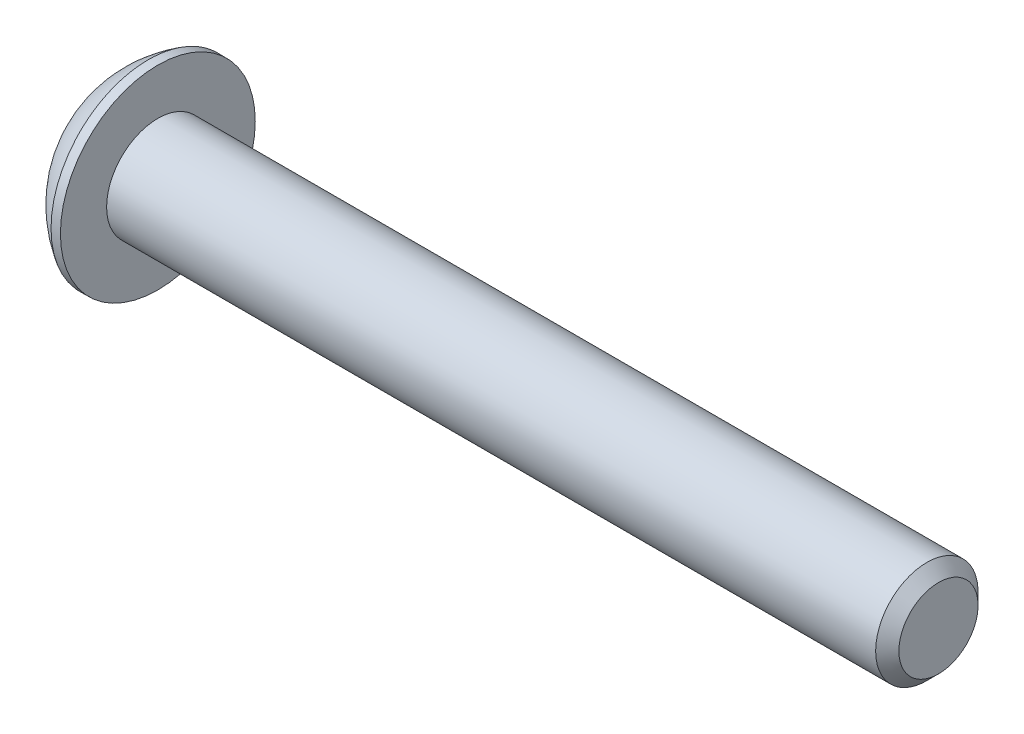
ISO-10303-21;
HEADER;
FILE_DESCRIPTION(('STEP AP214'),'2;1');
FILE_NAME('part.step','',(''),(''),'','','');
FILE_SCHEMA(('AUTOMOTIVE_DESIGN { 1 0 10303 214 1 1 1 1 }'));
ENDSEC;
DATA;
#1=APPLICATION_CONTEXT('core data for automotive mechanical design processes');
#2=APPLICATION_PROTOCOL_DEFINITION('international standard','automotive_design',2000,#1);
#3=PRODUCT_CONTEXT('',#1,'mechanical');
#4=PRODUCT('Part','Part','',(#3));
#5=PRODUCT_RELATED_PRODUCT_CATEGORY('part','',(#4));
#6=PRODUCT_DEFINITION_FORMATION('','',#4);
#7=PRODUCT_DEFINITION_CONTEXT('part definition',#1,'design');
#8=PRODUCT_DEFINITION('design','',#6,#7);
#9=PRODUCT_DEFINITION_SHAPE('','',#8);
#10=(LENGTH_UNIT() NAMED_UNIT(*) SI_UNIT(.MILLI.,.METRE.));
#11=(NAMED_UNIT(*) PLANE_ANGLE_UNIT() SI_UNIT($,.RADIAN.));
#12=(NAMED_UNIT(*) SI_UNIT($,.STERADIAN.) SOLID_ANGLE_UNIT());
#13=UNCERTAINTY_MEASURE_WITH_UNIT(LENGTH_MEASURE(1.E-05),#10,'distance_accuracy_value','');
#14=(GEOMETRIC_REPRESENTATION_CONTEXT(3) GLOBAL_UNCERTAINTY_ASSIGNED_CONTEXT((#13)) GLOBAL_UNIT_ASSIGNED_CONTEXT((#10,
#11,#12)) REPRESENTATION_CONTEXT('',''));
#15=CARTESIAN_POINT('',(0.,0.,0.));
#16=DIRECTION('',(0.,0.,1.));
#17=DIRECTION('',(1.,0.,0.));
#18=AXIS2_PLACEMENT_3D('',#15,#16,#17);
#19=CARTESIAN_POINT('',(1.32080000000034,0.,0.));
#20=DIRECTION('',(-1.,0.,0.));
#21=DIRECTION('',(0.,0.,1.));
#22=AXIS2_PLACEMENT_3D('',#19,#20,#21);
#23=CONICAL_SURFACE('',#22,1.1937999999998,1.04719755119608);
#24=CARTESIAN_POINT('',(2.01004075135902,0.,4.44089209850063E-13));
#25=VERTEX_POINT('',#24);
#26=VERTEX_LOOP('',#25);
#27=FACE_BOUND('',#26,.T.);
#28=CARTESIAN_POINT('',(1.32080000000009,0.,0.));
#29=DIRECTION('',(-1.,0.,0.));
#30=DIRECTION('',(0.,0.,1.));
#31=AXIS2_PLACEMENT_3D('',#28,#29,#30);
#32=CIRCLE('',#31,1.19380000000024);
#33=CARTESIAN_POINT('',(1.32080000000004,-1.03386112703797,0.59690000000006));
#34=VERTEX_POINT('',#33);
#35=CARTESIAN_POINT('',(1.32080000000004,0.,1.19380000000012));
#36=VERTEX_POINT('',#35);
#37=EDGE_CURVE('E18',#34,#36,#32,.T.);
#38=ORIENTED_EDGE('',*,*,#37,.T.);
#39=CARTESIAN_POINT('',(1.32080000000009,0.,0.));
#40=DIRECTION('',(-1.,0.,0.));
#41=DIRECTION('',(0.,0.,1.));
#42=AXIS2_PLACEMENT_3D('',#39,#40,#41);
#43=CIRCLE('',#42,1.19380000000024);
#44=CARTESIAN_POINT('',(1.32080000000004,1.03386112703797,0.596900000000061));
#45=VERTEX_POINT('',#44);
#46=EDGE_CURVE('E146',#36,#45,#43,.T.);
#47=ORIENTED_EDGE('',*,*,#46,.T.);
#48=CARTESIAN_POINT('',(1.32080000000009,0.,0.));
#49=DIRECTION('',(-1.,0.,0.));
#50=DIRECTION('',(0.,0.,1.));
#51=AXIS2_PLACEMENT_3D('',#48,#49,#50);
#52=CIRCLE('',#51,1.19380000000024);
#53=CARTESIAN_POINT('',(1.32080000000004,1.03386112703797,-0.596900000000061));
#54=VERTEX_POINT('',#53);
#55=EDGE_CURVE('E316',#45,#54,#52,.T.);
#56=ORIENTED_EDGE('',*,*,#55,.T.);
#57=CARTESIAN_POINT('',(1.32080000000009,0.,0.));
#58=DIRECTION('',(-1.,0.,0.));
#59=DIRECTION('',(0.,0.,1.));
#60=AXIS2_PLACEMENT_3D('',#57,#58,#59);
#61=CIRCLE('',#60,1.19380000000024);
#62=CARTESIAN_POINT('',(1.32080000000004,1.49457637585666E-12,-1.19380000000012));
#63=VERTEX_POINT('',#62);
#64=EDGE_CURVE('E317',#54,#63,#61,.T.);
#65=ORIENTED_EDGE('',*,*,#64,.T.);
#66=CARTESIAN_POINT('',(1.32080000000009,0.,0.));
#67=DIRECTION('',(-1.,0.,0.));
#68=DIRECTION('',(0.,0.,1.));
#69=AXIS2_PLACEMENT_3D('',#66,#67,#68);
#70=CIRCLE('',#69,1.19380000000024);
#71=CARTESIAN_POINT('',(1.32080000000004,-1.03386112703797,-0.59690000000006));
#72=VERTEX_POINT('',#71);
#73=EDGE_CURVE('E91',#63,#72,#70,.T.);
#74=ORIENTED_EDGE('',*,*,#73,.T.);
#75=CARTESIAN_POINT('',(1.32080000000009,0.,0.));
#76=DIRECTION('',(-1.,0.,0.));
#77=DIRECTION('',(0.,0.,1.));
#78=AXIS2_PLACEMENT_3D('',#75,#76,#77);
#79=CIRCLE('',#78,1.19380000000024);
#80=EDGE_CURVE('E87',#72,#34,#79,.T.);
#81=ORIENTED_EDGE('',*,*,#80,.T.);
#82=EDGE_LOOP('',(#38,#47,#56,#65,#74,#81));
#83=FACE_BOUND('',#82,.T.);
#84=ADVANCED_FACE('F15',(#27,#83),#23,.F.);
#85=CARTESIAN_POINT('',(1.3208,-2.06772225407572,-1.1938));
#86=DIRECTION('',(1.,0.,0.));
#87=DIRECTION('',(0.,0.,-1.));
#88=AXIS2_PLACEMENT_3D('',#85,#86,#87);
#89=PLANE('',#88);
#90=DIRECTION('',(0.,0.5,0.866025403784439));
#91=VECTOR('',#90,1.);
#92=CARTESIAN_POINT('',(1.3208,-1.37848150271715,0.));
#93=LINE('',#92,#91);
#94=CARTESIAN_POINT('',(1.3208,-0.689240751358574,1.1938));
#95=VERTEX_POINT('',#94);
#96=EDGE_CURVE('E99',#95,#34,#93,.F.);
#97=ORIENTED_EDGE('',*,*,#96,.F.);
#98=DIRECTION('',(0.,1.,0.));
#99=VECTOR('',#98,1.);
#100=CARTESIAN_POINT('',(1.3208,-0.689240751358574,1.1938));
#101=LINE('',#100,#99);
#102=EDGE_CURVE('E101',#36,#95,#101,.F.);
#103=ORIENTED_EDGE('',*,*,#102,.F.);
#104=ORIENTED_EDGE('',*,*,#37,.F.);
#105=EDGE_LOOP('',(#97,#103,#104));
#106=FACE_BOUND('',#105,.T.);
#107=ADVANCED_FACE('F97',(#106),#89,.F.);
#108=CARTESIAN_POINT('',(1.3208,-2.06772225407572,-1.1938));
#109=DIRECTION('',(1.,0.,0.));
#110=DIRECTION('',(0.,0.,-1.));
#111=AXIS2_PLACEMENT_3D('',#108,#109,#110);
#112=PLANE('',#111);
#113=DIRECTION('',(0.,-0.5,0.866025403784439));
#114=VECTOR('',#113,1.);
#115=CARTESIAN_POINT('',(1.3208,-0.689240751358574,-1.1938));
#116=LINE('',#115,#114);
#117=CARTESIAN_POINT('',(1.3208,-1.37848150271715,0.));
#118=VERTEX_POINT('',#117);
#119=EDGE_CURVE('E107',#118,#72,#116,.F.);
#120=ORIENTED_EDGE('',*,*,#119,.F.);
#121=DIRECTION('',(0.,0.5,0.866025403784439));
#122=VECTOR('',#121,1.);
#123=CARTESIAN_POINT('',(1.3208,-1.37848150271715,0.));
#124=LINE('',#123,#122);
#125=EDGE_CURVE('E104',#34,#118,#124,.F.);
#126=ORIENTED_EDGE('',*,*,#125,.F.);
#127=ORIENTED_EDGE('',*,*,#80,.F.);
#128=EDGE_LOOP('',(#120,#126,#127));
#129=FACE_BOUND('',#128,.T.);
#130=ADVANCED_FACE('F105',(#129),#112,.F.);
#131=CARTESIAN_POINT('',(1.3208,-2.06772225407572,-1.1938));
#132=DIRECTION('',(1.,0.,0.));
#133=DIRECTION('',(0.,0.,-1.));
#134=AXIS2_PLACEMENT_3D('',#131,#132,#133);
#135=PLANE('',#134);
#136=DIRECTION('',(0.,1.,0.));
#137=VECTOR('',#136,1.);
#138=CARTESIAN_POINT('',(1.3208,0.689240751358577,-1.1938));
#139=LINE('',#138,#137);
#140=CARTESIAN_POINT('',(1.3208,-0.689240751358574,-1.1938));
#141=VERTEX_POINT('',#140);
#142=EDGE_CURVE('E286',#141,#63,#139,.T.);
#143=ORIENTED_EDGE('',*,*,#142,.F.);
#144=DIRECTION('',(0.,-0.5,0.866025403784439));
#145=VECTOR('',#144,1.);
#146=CARTESIAN_POINT('',(1.3208,-0.689240751358574,-1.1938));
#147=LINE('',#146,#145);
#148=EDGE_CURVE('E298',#72,#141,#147,.F.);
#149=ORIENTED_EDGE('',*,*,#148,.F.);
#150=ORIENTED_EDGE('',*,*,#73,.F.);
#151=EDGE_LOOP('',(#143,#149,#150));
#152=FACE_BOUND('',#151,.T.);
#153=ADVANCED_FACE('F189',(#152),#135,.F.);
#154=CARTESIAN_POINT('',(1.3208,-2.06772225407572,-1.1938));
#155=DIRECTION('',(1.,0.,0.));
#156=DIRECTION('',(0.,0.,-1.));
#157=AXIS2_PLACEMENT_3D('',#154,#155,#156);
#158=PLANE('',#157);
#159=DIRECTION('',(0.,-0.5,-0.866025403784439));
#160=VECTOR('',#159,1.);
#161=CARTESIAN_POINT('',(1.3208,1.37848150271715,0.));
#162=LINE('',#161,#160);
#163=CARTESIAN_POINT('',(1.3208,0.689240751358577,-1.1938));
#164=VERTEX_POINT('',#163);
#165=EDGE_CURVE('E272',#164,#54,#162,.F.);
#166=ORIENTED_EDGE('',*,*,#165,.F.);
#167=DIRECTION('',(0.,1.,0.));
#168=VECTOR('',#167,1.);
#169=CARTESIAN_POINT('',(1.3208,0.689240751358577,-1.1938));
#170=LINE('',#169,#168);
#171=EDGE_CURVE('E283',#63,#164,#170,.T.);
#172=ORIENTED_EDGE('',*,*,#171,.F.);
#173=ORIENTED_EDGE('',*,*,#64,.F.);
#174=EDGE_LOOP('',(#166,#172,#173));
#175=FACE_BOUND('',#174,.T.);
#176=ADVANCED_FACE('F185',(#175),#158,.F.);
#177=CARTESIAN_POINT('',(1.3208,-2.06772225407572,-1.1938));
#178=DIRECTION('',(1.,0.,0.));
#179=DIRECTION('',(0.,0.,-1.));
#180=AXIS2_PLACEMENT_3D('',#177,#178,#179);
#181=PLANE('',#180);
#182=DIRECTION('',(0.,0.5,-0.866025403784439));
#183=VECTOR('',#182,1.);
#184=CARTESIAN_POINT('',(1.3208,0.689240751358576,1.1938));
#185=LINE('',#184,#183);
#186=CARTESIAN_POINT('',(1.3208,1.37848150271715,0.));
#187=VERTEX_POINT('',#186);
#188=EDGE_CURVE('E251',#187,#45,#185,.F.);
#189=ORIENTED_EDGE('',*,*,#188,.F.);
#190=DIRECTION('',(0.,-0.5,-0.866025403784439));
#191=VECTOR('',#190,1.);
#192=CARTESIAN_POINT('',(1.3208,1.37848150271715,0.));
#193=LINE('',#192,#191);
#194=EDGE_CURVE('E270',#54,#187,#193,.F.);
#195=ORIENTED_EDGE('',*,*,#194,.F.);
#196=ORIENTED_EDGE('',*,*,#55,.F.);
#197=EDGE_LOOP('',(#189,#195,#196));
#198=FACE_BOUND('',#197,.T.);
#199=ADVANCED_FACE('F181',(#198),#181,.F.);
#200=CARTESIAN_POINT('',(1.3208,-2.06772225407572,-1.1938));
#201=DIRECTION('',(1.,0.,0.));
#202=DIRECTION('',(0.,0.,-1.));
#203=AXIS2_PLACEMENT_3D('',#200,#201,#202);
#204=PLANE('',#203);
#205=DIRECTION('',(0.,1.,0.));
#206=VECTOR('',#205,1.);
#207=CARTESIAN_POINT('',(1.3208,-0.689240751358574,1.1938));
#208=LINE('',#207,#206);
#209=CARTESIAN_POINT('',(1.3208,0.689240751358576,1.1938));
#210=VERTEX_POINT('',#209);
#211=EDGE_CURVE('E116',#210,#36,#208,.F.);
#212=ORIENTED_EDGE('',*,*,#211,.F.);
#213=DIRECTION('',(0.,0.5,-0.866025403784439));
#214=VECTOR('',#213,1.);
#215=CARTESIAN_POINT('',(1.3208,0.689240751358576,1.1938));
#216=LINE('',#215,#214);
#217=EDGE_CURVE('E254',#45,#210,#216,.F.);
#218=ORIENTED_EDGE('',*,*,#217,.F.);
#219=ORIENTED_EDGE('',*,*,#46,.F.);
#220=EDGE_LOOP('',(#212,#218,#219));
#221=FACE_BOUND('',#220,.T.);
#222=ADVANCED_FACE('F177',(#221),#204,.F.);
#223=CARTESIAN_POINT('',(1.3208,-0.689240751358574,1.1938));
#224=DIRECTION('',(0.,0.,-1.));
#225=DIRECTION('',(0.,1.,0.));
#226=AXIS2_PLACEMENT_3D('',#223,#224,#225);
#227=PLANE('',#226);
#228=DIRECTION('',(0.,1.,0.));
#229=VECTOR('',#228,1.);
#230=CARTESIAN_POINT('',(0.,0.,1.1938));
#231=LINE('',#230,#229);
#232=CARTESIAN_POINT('',(0.,0.689240751358577,1.1938));
#233=VERTEX_POINT('',#232);
#234=CARTESIAN_POINT('',(0.,-0.689240751358574,1.1938));
#235=VERTEX_POINT('',#234);
#236=EDGE_CURVE('E248',#233,#235,#231,.F.);
#237=ORIENTED_EDGE('',*,*,#236,.F.);
#238=DIRECTION('',(1.,0.,0.));
#239=VECTOR('',#238,1.);
#240=CARTESIAN_POINT('',(1.3208,0.689240751358576,1.1938));
#241=LINE('',#240,#239);
#242=EDGE_CURVE('E260',#210,#233,#241,.F.);
#243=ORIENTED_EDGE('',*,*,#242,.F.);
#244=ORIENTED_EDGE('',*,*,#211,.T.);
#245=ORIENTED_EDGE('',*,*,#102,.T.);
#246=DIRECTION('',(1.,0.,0.));
#247=VECTOR('',#246,1.);
#248=CARTESIAN_POINT('',(1.3208,-0.689240751358574,1.1938));
#249=LINE('',#248,#247);
#250=EDGE_CURVE('E110',#235,#95,#249,.T.);
#251=ORIENTED_EDGE('',*,*,#250,.F.);
#252=EDGE_LOOP('',(#237,#243,#244,#245,#251));
#253=FACE_BOUND('',#252,.T.);
#254=ADVANCED_FACE('F174',(#253),#227,.T.);
#255=CARTESIAN_POINT('',(1.3208,-1.37848150271715,0.));
#256=DIRECTION('',(0.,0.866025403784439,-0.5));
#257=DIRECTION('',(0.,0.5,0.866025403784439));
#258=AXIS2_PLACEMENT_3D('',#255,#256,#257);
#259=PLANE('',#258);
#260=DIRECTION('',(0.,-0.5,-0.866025403784439));
#261=VECTOR('',#260,1.);
#262=CARTESIAN_POINT('',(0.,-0.689240751358574,1.1938));
#263=LINE('',#262,#261);
#264=CARTESIAN_POINT('',(0.,-1.37848150271715,0.));
#265=VERTEX_POINT('',#264);
#266=EDGE_CURVE('E245',#235,#265,#263,.T.);
#267=ORIENTED_EDGE('',*,*,#266,.F.);
#268=ORIENTED_EDGE('',*,*,#250,.T.);
#269=ORIENTED_EDGE('',*,*,#96,.T.);
#270=ORIENTED_EDGE('',*,*,#125,.T.);
#271=DIRECTION('',(1.,0.,0.));
#272=VECTOR('',#271,1.);
#273=CARTESIAN_POINT('',(1.3208,-1.37848150271715,0.));
#274=LINE('',#273,#272);
#275=EDGE_CURVE('E295',#265,#118,#274,.T.);
#276=ORIENTED_EDGE('',*,*,#275,.F.);
#277=EDGE_LOOP('',(#267,#268,#269,#270,#276));
#278=FACE_BOUND('',#277,.T.);
#279=ADVANCED_FACE('F114',(#278),#259,.T.);
#280=CARTESIAN_POINT('',(1.3208,-0.689240751358574,-1.1938));
#281=DIRECTION('',(0.,0.866025403784439,0.5));
#282=DIRECTION('',(0.,-0.5,0.866025403784439));
#283=AXIS2_PLACEMENT_3D('',#280,#281,#282);
#284=PLANE('',#283);
#285=DIRECTION('',(0.,0.5,-0.866025403784439));
#286=VECTOR('',#285,1.);
#287=CARTESIAN_POINT('',(0.,-1.37848150271715,0.));
#288=LINE('',#287,#286);
#289=CARTESIAN_POINT('',(0.,-0.689240751358574,-1.1938));
#290=VERTEX_POINT('',#289);
#291=EDGE_CURVE('E242',#265,#290,#288,.T.);
#292=ORIENTED_EDGE('',*,*,#291,.F.);
#293=ORIENTED_EDGE('',*,*,#275,.T.);
#294=ORIENTED_EDGE('',*,*,#119,.T.);
#295=ORIENTED_EDGE('',*,*,#148,.T.);
#296=DIRECTION('',(1.,0.,0.));
#297=VECTOR('',#296,1.);
#298=CARTESIAN_POINT('',(1.3208,-0.689240751358574,-1.1938));
#299=LINE('',#298,#297);
#300=EDGE_CURVE('E280',#290,#141,#299,.T.);
#301=ORIENTED_EDGE('',*,*,#300,.F.);
#302=EDGE_LOOP('',(#292,#293,#294,#295,#301));
#303=FACE_BOUND('',#302,.T.);
#304=ADVANCED_FACE('F167',(#303),#284,.T.);
#305=CARTESIAN_POINT('',(1.3208,0.689240751358577,-1.1938));
#306=DIRECTION('',(0.,0.,1.));
#307=DIRECTION('',(1.,0.,0.));
#308=AXIS2_PLACEMENT_3D('',#305,#306,#307);
#309=PLANE('',#308);
#310=DIRECTION('',(0.,1.,0.));
#311=VECTOR('',#310,1.);
#312=CARTESIAN_POINT('',(0.,0.,-1.1938));
#313=LINE('',#312,#311);
#314=CARTESIAN_POINT('',(0.,0.689240751358577,-1.1938));
#315=VERTEX_POINT('',#314);
#316=EDGE_CURVE('E239',#290,#315,#313,.T.);
#317=ORIENTED_EDGE('',*,*,#316,.F.);
#318=ORIENTED_EDGE('',*,*,#300,.T.);
#319=ORIENTED_EDGE('',*,*,#142,.T.);
#320=ORIENTED_EDGE('',*,*,#171,.T.);
#321=DIRECTION('',(1.,0.,0.));
#322=VECTOR('',#321,1.);
#323=CARTESIAN_POINT('',(1.3208,0.689240751358577,-1.1938));
#324=LINE('',#323,#322);
#325=EDGE_CURVE('E255',#315,#164,#324,.T.);
#326=ORIENTED_EDGE('',*,*,#325,.F.);
#327=EDGE_LOOP('',(#317,#318,#319,#320,#326));
#328=FACE_BOUND('',#327,.T.);
#329=ADVANCED_FACE('F164',(#328),#309,.T.);
#330=CARTESIAN_POINT('',(1.3208,1.37848150271715,0.));
#331=DIRECTION('',(0.,-0.866025403784439,0.5));
#332=DIRECTION('',(0.,-0.5,-0.866025403784439));
#333=AXIS2_PLACEMENT_3D('',#330,#331,#332);
#334=PLANE('',#333);
#335=DIRECTION('',(0.,0.5,0.866025403784439));
#336=VECTOR('',#335,1.);
#337=CARTESIAN_POINT('',(0.,0.689240751358577,-1.1938));
#338=LINE('',#337,#336);
#339=CARTESIAN_POINT('',(0.,1.37848150271715,0.));
#340=VERTEX_POINT('',#339);
#341=EDGE_CURVE('E236',#315,#340,#338,.T.);
#342=ORIENTED_EDGE('',*,*,#341,.F.);
#343=ORIENTED_EDGE('',*,*,#325,.T.);
#344=ORIENTED_EDGE('',*,*,#165,.T.);
#345=ORIENTED_EDGE('',*,*,#194,.T.);
#346=DIRECTION('',(1.,0.,0.));
#347=VECTOR('',#346,1.);
#348=CARTESIAN_POINT('',(1.3208,1.37848150271715,0.));
#349=LINE('',#348,#347);
#350=EDGE_CURVE('E33',#340,#187,#349,.T.);
#351=ORIENTED_EDGE('',*,*,#350,.F.);
#352=EDGE_LOOP('',(#342,#343,#344,#345,#351));
#353=FACE_BOUND('',#352,.T.);
#354=ADVANCED_FACE('F160',(#353),#334,.T.);
#355=CARTESIAN_POINT('',(1.3208,0.689240751358576,1.1938));
#356=DIRECTION('',(0.,-0.866025403784439,-0.5));
#357=DIRECTION('',(0.,0.5,-0.866025403784439));
#358=AXIS2_PLACEMENT_3D('',#355,#356,#357);
#359=PLANE('',#358);
#360=DIRECTION('',(0.,-0.5,0.866025403784439));
#361=VECTOR('',#360,1.);
#362=CARTESIAN_POINT('',(0.,1.37848150271715,0.));
#363=LINE('',#362,#361);
#364=EDGE_CURVE('E145',#340,#233,#363,.T.);
#365=ORIENTED_EDGE('',*,*,#364,.F.);
#366=ORIENTED_EDGE('',*,*,#350,.T.);
#367=ORIENTED_EDGE('',*,*,#188,.T.);
#368=ORIENTED_EDGE('',*,*,#217,.T.);
#369=ORIENTED_EDGE('',*,*,#242,.T.);
#370=EDGE_LOOP('',(#365,#366,#367,#368,#369));
#371=FACE_BOUND('',#370,.T.);
#372=ADVANCED_FACE('F156',(#371),#359,.T.);
#373=CARTESIAN_POINT('',(0.,0.,0.));
#374=DIRECTION('',(-1.,0.,0.));
#375=DIRECTION('',(0.,0.,1.));
#376=AXIS2_PLACEMENT_3D('',#373,#374,#375);
#377=PLANE('',#376);
#378=ORIENTED_EDGE('',*,*,#341,.T.);
#379=ORIENTED_EDGE('',*,*,#364,.T.);
#380=ORIENTED_EDGE('',*,*,#236,.T.);
#381=ORIENTED_EDGE('',*,*,#266,.T.);
#382=ORIENTED_EDGE('',*,*,#291,.T.);
#383=ORIENTED_EDGE('',*,*,#316,.T.);
#384=EDGE_LOOP('',(#378,#379,#380,#381,#382,#383));
#385=FACE_BOUND('',#384,.T.);
#386=CARTESIAN_POINT('',(0.,1.9812,0.));
#387=CARTESIAN_POINT('',(0.,1.9811996664299,0.0556258831179428));
#388=CARTESIAN_POINT('',(0.,1.97885520380442,0.111261989398606));
#389=CARTESIAN_POINT('',(0.,1.96949260169541,0.222149719830458));
#390=CARTESIAN_POINT('',(0.,1.96247308239605,0.277401225602895));
#391=CARTESIAN_POINT('',(0.,1.94379192841038,0.387209508139747));
#392=CARTESIAN_POINT('',(-1.85325793235264E-13,1.93212292489526,0.441765039546365));
#393=CARTESIAN_POINT('',(1.86344214223505E-13,1.90422331175315,0.549729449347493));
#394=CARTESIAN_POINT('',(6.94543371897454E-13,1.88798900035338,0.603137359208869));
#395=CARTESIAN_POINT('',(1.15501975216981E-12,1.83266214476501,0.760839131321828));
#396=CARTESIAN_POINT('',(0.,1.78690023648845,0.862876433575429));
#397=CARTESIAN_POINT('',(0.,1.67887358150667,1.05780719540872));
#398=CARTESIAN_POINT('',(9.54193214892627E-13,1.6166082074585,1.15070030720801));
#399=CARTESIAN_POINT('',(5.94805591894675E-13,1.51224157140982,1.28116890915697));
#400=CARTESIAN_POINT('',(1.63221293851378E-13,1.4755970394354,1.32320451127026));
#401=CARTESIAN_POINT('',(-1.62196980336157E-13,1.39893832619713,1.40400288695709));
#402=CARTESIAN_POINT('',(0.,1.35892742784698,1.44276877695455));
#403=CARTESIAN_POINT('',(1.14362537325405E-13,1.23416504602197,1.55382272417904));
#404=CARTESIAN_POINT('',(0.,1.14466125559859,1.62089527952111));
#405=CARTESIAN_POINT('',(0.,0.955712144178167,1.7390221808118));
#406=CARTESIAN_POINT('',(0.,0.856267198233564,1.79007713076007));
#407=CARTESIAN_POINT('',(0.,0.650206345910843,1.87477637530954));
#408=CARTESIAN_POINT('',(0.,0.543590516134855,1.90842085586267));
#409=CARTESIAN_POINT('',(0.,0.326226155292018,1.95733039300656));
#410=CARTESIAN_POINT('',(0.,0.21547760215793,1.97259535144288));
#411=CARTESIAN_POINT('',(0.,-0.00701040587544639,1.98431697865418));
#412=CARTESIAN_POINT('',(0.,-0.118749860774734,1.98077364742917));
#413=CARTESIAN_POINT('',(0.,-0.340050178355485,1.95497485623825));
#414=CARTESIAN_POINT('',(0.,-0.449611052668255,1.93271949620218));
#415=CARTESIAN_POINT('',(0.,-0.663431110729174,1.87014138774523));
#416=CARTESIAN_POINT('',(0.,-0.76769023783852,1.82981844635272));
#417=CARTESIAN_POINT('',(0.,-0.968005760719347,1.73219968377096));
#418=CARTESIAN_POINT('',(0.,-1.0640618469811,1.6749032225164));
#419=CARTESIAN_POINT('',(0.,-1.19980276751283,1.57757371205873));
#420=CARTESIAN_POINT('',(0.,-1.24366557129213,1.54322665019466));
#421=CARTESIAN_POINT('',(0.,-1.32838995706696,1.47093063174264));
#422=CARTESIAN_POINT('',(0.,-1.36924860178706,1.43297823102439));
#423=CARTESIAN_POINT('',(0.,-1.48674671849223,1.31419842051173));
#424=CARTESIAN_POINT('',(0.,-1.55842832343237,1.22836221289311));
#425=CARTESIAN_POINT('',(0.,-1.6863396856475,1.04586168272493));
#426=CARTESIAN_POINT('',(0.,-1.7425700302488,0.949197771949774));
#427=CARTESIAN_POINT('',(0.,-1.8141614250401,0.798182600298684));
#428=CARTESIAN_POINT('',(0.,-1.83591780585875,0.746776203847791));
#429=CARTESIAN_POINT('',(0.,-1.87500754181092,0.642341081688636));
#430=CARTESIAN_POINT('',(0.,-1.89234447645404,0.589313708122847));
#431=CARTESIAN_POINT('',(0.,-1.92246053433554,0.482076273028395));
#432=CARTESIAN_POINT('',(0.,-1.93524685475118,0.42786822425751));
#433=CARTESIAN_POINT('',(0.,-1.95620937250494,0.318578151844611));
#434=CARTESIAN_POINT('',(0.,-1.96438692958147,0.263496390912872));
#435=CARTESIAN_POINT('',(0.,-1.97388528284653,0.173607715038558));
#436=CARTESIAN_POINT('',(0.,-1.97662743364426,0.138944718024998));
#437=CARTESIAN_POINT('',(0.,-1.98028489645283,0.0695224782567002));
#438=CARTESIAN_POINT('',(0.,-1.98120020846367,0.0347632355019631));
#439=CARTESIAN_POINT('',(0.,-1.9811996664299,-0.0556258831179437));
#440=CARTESIAN_POINT('',(0.,-1.97885520380442,-0.111261989398607));
#441=CARTESIAN_POINT('',(0.,-1.96949260169541,-0.222149719830459));
#442=CARTESIAN_POINT('',(0.,-1.96247308239605,-0.277401225602897));
#443=CARTESIAN_POINT('',(0.,-1.94379192841039,-0.387209508139749));
#444=CARTESIAN_POINT('',(-1.85269749640691E-13,-1.93212292489526,-0.441765039546367));
#445=CARTESIAN_POINT('',(1.86288125054388E-13,-1.90422331175315,-0.549729449347495));
#446=CARTESIAN_POINT('',(6.94525090263764E-13,-1.88798900035338,-0.603137359208872));
#447=CARTESIAN_POINT('',(1.15505622829081E-12,-1.83266214476501,-0.760839131321831));
#448=CARTESIAN_POINT('',(0.,-1.78690023648845,-0.862876433575431));
#449=CARTESIAN_POINT('',(0.,-1.67887358150667,-1.05780719540872));
#450=CARTESIAN_POINT('',(9.54248812869379E-13,-1.6166082074585,-1.15070030720801));
#451=CARTESIAN_POINT('',(5.94777756479239E-13,-1.51224157140982,-1.28116890915698));
#452=CARTESIAN_POINT('',(1.63138949183833E-13,-1.47559703943539,-1.32320451127027));
#453=CARTESIAN_POINT('',(-1.62114715061273E-13,-1.39893832619713,-1.40400288695709));
#454=CARTESIAN_POINT('',(0.,-1.35892742784699,-1.44276877695455));
#455=CARTESIAN_POINT('',(1.13760489124207E-13,-1.23416504602197,-1.55382272417904));
#456=CARTESIAN_POINT('',(0.,-1.14466125559859,-1.62089527952111));
#457=CARTESIAN_POINT('',(0.,-0.95571214417816,-1.73902218081179));
#458=CARTESIAN_POINT('',(0.,-0.856267198233559,-1.79007713076007));
#459=CARTESIAN_POINT('',(0.,-0.650206345910841,-1.87477637530954));
#460=CARTESIAN_POINT('',(0.,-0.543590516134854,-1.90842085586267));
#461=CARTESIAN_POINT('',(0.,-0.326226155292018,-1.95733039300657));
#462=CARTESIAN_POINT('',(0.,-0.215477602157929,-1.97259535144288));
#463=CARTESIAN_POINT('',(0.,0.0070104058754487,-1.98431697865418));
#464=CARTESIAN_POINT('',(0.,0.118749860774737,-1.98077364742916));
#465=CARTESIAN_POINT('',(0.,0.340050178355489,-1.95497485623824));
#466=CARTESIAN_POINT('',(0.,0.44961105266826,-1.93271949620218));
#467=CARTESIAN_POINT('',(0.,0.663431110729178,-1.87014138774524));
#468=CARTESIAN_POINT('',(0.,0.767690237838524,-1.82981844635272));
#469=CARTESIAN_POINT('',(0.,0.968005760719348,-1.73219968377096));
#470=CARTESIAN_POINT('',(0.,1.0640618469811,-1.67490322251639));
#471=CARTESIAN_POINT('',(0.,1.19980276751283,-1.57757371205873));
#472=CARTESIAN_POINT('',(0.,1.24366557129214,-1.54322665019465));
#473=CARTESIAN_POINT('',(0.,1.32838995706696,-1.47093063174263));
#474=CARTESIAN_POINT('',(0.,1.36924860178706,-1.43297823102439));
#475=CARTESIAN_POINT('',(0.,1.48674671849223,-1.31419842051172));
#476=CARTESIAN_POINT('',(0.,1.55842832343237,-1.22836221289311));
#477=CARTESIAN_POINT('',(0.,1.6863396856475,-1.04586168272492));
#478=CARTESIAN_POINT('',(0.,1.7425700302488,-0.949197771949768));
#479=CARTESIAN_POINT('',(0.,1.8141614250401,-0.798182600298677));
#480=CARTESIAN_POINT('',(0.,1.83591780585875,-0.746776203847785));
#481=CARTESIAN_POINT('',(0.,1.87500754181092,-0.64234108168863));
#482=CARTESIAN_POINT('',(0.,1.89234447645404,-0.589313708122841));
#483=CARTESIAN_POINT('',(0.,1.92246053433555,-0.482076273028389));
#484=CARTESIAN_POINT('',(0.,1.93524685475118,-0.427868224257505));
#485=CARTESIAN_POINT('',(0.,1.95620937250494,-0.318578151844605));
#486=CARTESIAN_POINT('',(0.,1.96438692958147,-0.263496390912866));
#487=CARTESIAN_POINT('',(0.,1.97388528284653,-0.173607715038553));
#488=CARTESIAN_POINT('',(0.,1.97662743364426,-0.138944718024994));
#489=CARTESIAN_POINT('',(0.,1.98028489645283,-0.0695224782566989));
#490=CARTESIAN_POINT('',(0.,1.98120020846367,-0.034763235501963));
#491=CARTESIAN_POINT('',(0.,1.9812,0.));
#492=B_SPLINE_CURVE_WITH_KNOTS('',3,(#386,#387,#388,#389,#390,#391,#392,#393,#394,#395,#396,
#397,#398,#399,#400,#401,#402,#403,#404,#405,#406,#407,#408,#409,#410,#411,#412,#413,#414,#415,
#416,#417,#418,#419,#420,#421,#422,#423,#424,#425,#426,#427,#428,#429,#430,#431,#432,#433,#434,
#435,#436,#437,#438,#439,#440,#441,#442,#443,#444,#445,#446,#447,#448,#449,#450,#451,#452,#453,
#454,#455,#456,#457,#458,#459,#460,#461,#462,#463,#464,#465,#466,#467,#468,#469,#470,#471,#472,
#473,#474,#475,#476,#477,#478,#479,#480,#481,#482,#483,#484,#485,#486,#487,#488,#489,#490,#491),
.UNSPECIFIED.,.T.,.F.,(4,2,2,2,2,2,2,2,2,2,2,2,2,2,2,2,2,2,2,2,2,2,2,2,2,2,2,2,2,2,2,2,2,2,2,2,
2,2,2,2,2,2,2,2,2,2,2,2,2,2,2,2,4),(0.,0.166845646007828,0.333740557374255,0.500901034367693,
0.668197445942386,1.00199278686282,1.33580081809885,1.50292354032982,1.6698851310853,
2.00370118900129,2.33750465770544,2.67130456115909,3.005106247238,3.33890793331696,
3.67270783677065,4.00651130547476,4.34032736339026,4.50728895414554,4.67441167637632,
5.00821970761259,5.34201504853332,5.50931146010827,5.67647193710191,5.84336684846844,
6.0102124944764,6.11448220058334,6.21875190669029,6.38559755269812,6.55249246406454,
6.71965294105798,6.88694935263268,7.22074469355311,7.55455272478915,7.72167544702011,
7.88863703777559,8.22245309569158,8.55625656439573,8.89005646784938,9.2238581539283,
9.55765984000725,9.89145974346094,10.2252632121651,10.5590792700806,10.7260408608358,
10.8931635830666,11.2269716143029,11.5607669552236,11.7280633667986,11.8952238437922,
12.0621187551587,12.2289644011667,12.3332341072736,12.4375038133806),.UNSPECIFIED.);
#493=CARTESIAN_POINT('',(0.,1.9812,0.));
#494=VERTEX_POINT('',#493);
#495=EDGE_CURVE('E138',#494,#494,#492,.T.);
#496=ORIENTED_EDGE('',*,*,#495,.F.);
#497=EDGE_LOOP('',(#496));
#498=FACE_BOUND('',#497,.T.);
#499=ADVANCED_FACE('F152',(#385,#498),#377,.T.);
#500=CARTESIAN_POINT('',(4.13385,0.,0.));
#501=DIRECTION('',(0.,1.,0.));
#502=DIRECTION('',(1.,0.,0.));
#503=AXIS2_PLACEMENT_3D('',#500,#501,#502);
#504=SPHERICAL_SURFACE('',#503,4.58408870578439);
#505=CARTESIAN_POINT('',(1.8288,0.,0.));
#506=DIRECTION('',(-1.,0.,0.));
#507=DIRECTION('',(0.,0.,1.));
#508=AXIS2_PLACEMENT_3D('',#505,#506,#507);
#509=CIRCLE('',#508,3.9624);
#510=CARTESIAN_POINT('',(1.8288,0.,3.9624));
#511=VERTEX_POINT('',#510);
#512=EDGE_CURVE('E135',#511,#511,#509,.F.);
#513=ORIENTED_EDGE('',*,*,#512,.F.);
#514=EDGE_LOOP('',(#513));
#515=FACE_BOUND('',#514,.T.);
#516=ORIENTED_EDGE('',*,*,#495,.T.);
#517=EDGE_LOOP('',(#516));
#518=FACE_BOUND('',#517,.T.);
#519=ADVANCED_FACE('F148',(#515,#518),#504,.T.);
#520=CARTESIAN_POINT('',(33.9598,0.,0.));
#521=DIRECTION('',(-1.,0.,0.));
#522=DIRECTION('',(0.,0.,1.));
#523=AXIS2_PLACEMENT_3D('',#520,#521,#522);
#524=PLANE('',#523);
#525=CARTESIAN_POINT('',(33.9597999999341,0.,0.));
#526=DIRECTION('',(-1.,0.,0.));
#527=DIRECTION('',(0.,0.,1.));
#528=AXIS2_PLACEMENT_3D('',#525,#526,#527);
#529=CIRCLE('',#528,1.61036000002923);
#530=CARTESIAN_POINT('',(33.9597999999341,0.,1.61036000002923));
#531=VERTEX_POINT('',#530);
#532=EDGE_CURVE('E132',#531,#531,#529,.T.);
#533=ORIENTED_EDGE('',*,*,#532,.F.);
#534=EDGE_LOOP('',(#533));
#535=FACE_BOUND('',#534,.T.);
#536=ADVANCED_FACE('F220',(#535),#524,.F.);
#537=CARTESIAN_POINT('',(0.,0.,0.));
#538=DIRECTION('',(-1.,0.,0.));
#539=DIRECTION('',(0.,0.,1.));
#540=AXIS2_PLACEMENT_3D('',#537,#538,#539);
#541=CYLINDRICAL_SURFACE('',#540,3.9624);
#542=ORIENTED_EDGE('',*,*,#512,.T.);
#543=EDGE_LOOP('',(#542));
#544=FACE_BOUND('',#543,.T.);
#545=CARTESIAN_POINT('',(2.2098,0.,0.));
#546=DIRECTION('',(-1.,0.,0.));
#547=DIRECTION('',(0.,0.,1.));
#548=AXIS2_PLACEMENT_3D('',#545,#546,#547);
#549=CIRCLE('',#548,3.9624);
#550=CARTESIAN_POINT('',(2.2098,0.,3.9624));
#551=VERTEX_POINT('',#550);
#552=EDGE_CURVE('E129',#551,#551,#549,.T.);
#553=ORIENTED_EDGE('',*,*,#552,.T.);
#554=EDGE_LOOP('',(#553));
#555=FACE_BOUND('',#554,.T.);
#556=ADVANCED_FACE('F217',(#544,#555),#541,.T.);
#557=CARTESIAN_POINT('',(33.4873600000378,0.,0.));
#558=DIRECTION('',(-1.,0.,0.));
#559=DIRECTION('',(0.,0.,1.));
#560=AXIS2_PLACEMENT_3D('',#557,#558,#559);
#561=CONICAL_SURFACE('',#560,2.08279999992556,0.785398163397448);
#562=ORIENTED_EDGE('',*,*,#532,.T.);
#563=EDGE_LOOP('',(#562));
#564=FACE_BOUND('',#563,.T.);
#565=CARTESIAN_POINT('',(33.48736,0.,0.));
#566=DIRECTION('',(-1.,0.,0.));
#567=DIRECTION('',(0.,0.,1.));
#568=AXIS2_PLACEMENT_3D('',#565,#566,#567);
#569=CIRCLE('',#568,2.0828);
#570=CARTESIAN_POINT('',(33.48736,0.,2.0828));
#571=VERTEX_POINT('',#570);
#572=EDGE_CURVE('E24',#571,#571,#569,.T.);
#573=ORIENTED_EDGE('',*,*,#572,.F.);
#574=EDGE_LOOP('',(#573));
#575=FACE_BOUND('',#574,.T.);
#576=ADVANCED_FACE('F209',(#564,#575),#561,.T.);
#577=CARTESIAN_POINT('',(2.2098,2.0828,0.));
#578=DIRECTION('',(-1.,0.,0.));
#579=DIRECTION('',(0.,0.,1.));
#580=AXIS2_PLACEMENT_3D('',#577,#578,#579);
#581=PLANE('',#580);
#582=CARTESIAN_POINT('',(2.2098,0.,0.));
#583=DIRECTION('',(-1.,0.,0.));
#584=DIRECTION('',(0.,0.,1.));
#585=AXIS2_PLACEMENT_3D('',#582,#583,#584);
#586=CIRCLE('',#585,2.0828);
#587=CARTESIAN_POINT('',(2.2098,0.,2.0828));
#588=VERTEX_POINT('',#587);
#589=EDGE_CURVE('E10',#588,#588,#586,.F.);
#590=ORIENTED_EDGE('',*,*,#589,.F.);
#591=EDGE_LOOP('',(#590));
#592=FACE_BOUND('',#591,.T.);
#593=ORIENTED_EDGE('',*,*,#552,.F.);
#594=EDGE_LOOP('',(#593));
#595=FACE_BOUND('',#594,.T.);
#596=ADVANCED_FACE('F203',(#592,#595),#581,.F.);
#597=CARTESIAN_POINT('',(0.,0.,0.));
#598=DIRECTION('',(-1.,0.,0.));
#599=DIRECTION('',(0.,0.,1.));
#600=AXIS2_PLACEMENT_3D('',#597,#598,#599);
#601=CYLINDRICAL_SURFACE('',#600,2.0828);
#602=ORIENTED_EDGE('',*,*,#572,.T.);
#603=EDGE_LOOP('',(#602));
#604=FACE_BOUND('',#603,.T.);
#605=ORIENTED_EDGE('',*,*,#589,.T.);
#606=EDGE_LOOP('',(#605));
#607=FACE_BOUND('',#606,.T.);
#608=ADVANCED_FACE('F201',(#604,#607),#601,.T.);
#609=CLOSED_SHELL('',(#84,#107,#130,#153,#176,#199,#222,#254,#279,#304,#329,#354,#372,#499,#519,
#536,#556,#576,#596,#608));
#610=MANIFOLD_SOLID_BREP('B1',#609);
#611=ADVANCED_BREP_SHAPE_REPRESENTATION('',(#18,#610),#14);
#612=SHAPE_DEFINITION_REPRESENTATION(#9,#611);
ENDSEC;
END-ISO-10303-21;
